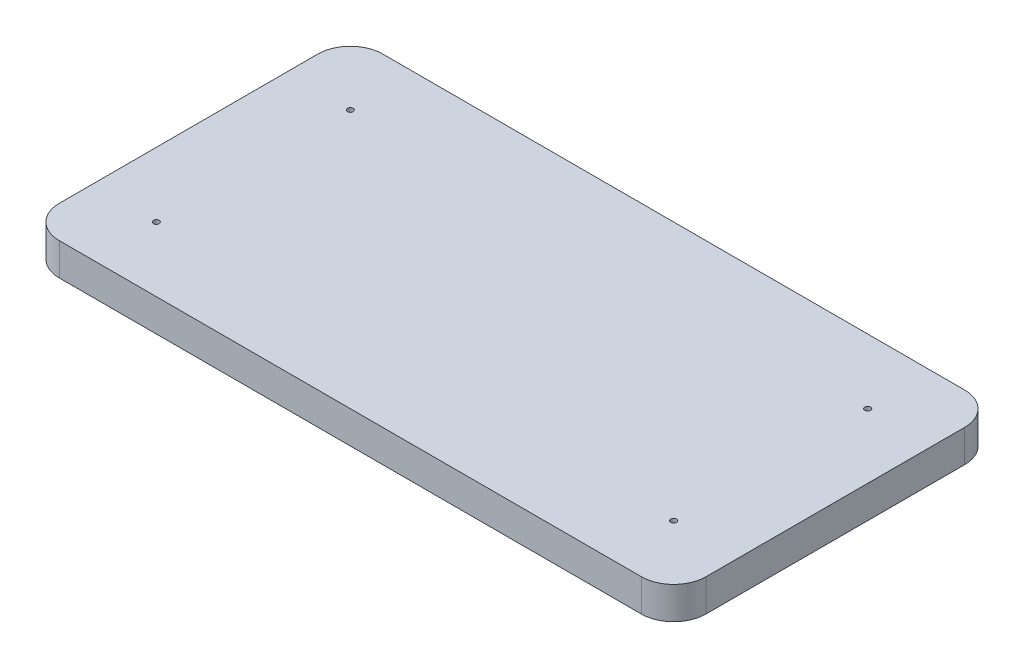
ISO-10303-21;
HEADER;
FILE_DESCRIPTION(('STEP AP214'),'2;1');
FILE_NAME('part.step','',(''),(''),'','','');
FILE_SCHEMA(('AUTOMOTIVE_DESIGN { 1 0 10303 214 1 1 1 1 }'));
ENDSEC;
DATA;
#1=APPLICATION_CONTEXT('core data for automotive mechanical design processes');
#2=APPLICATION_PROTOCOL_DEFINITION('international standard','automotive_design',2000,#1);
#3=PRODUCT_CONTEXT('',#1,'mechanical');
#4=PRODUCT('Part','Part','',(#3));
#5=PRODUCT_RELATED_PRODUCT_CATEGORY('part','',(#4));
#6=PRODUCT_DEFINITION_FORMATION('','',#4);
#7=PRODUCT_DEFINITION_CONTEXT('part definition',#1,'design');
#8=PRODUCT_DEFINITION('design','',#6,#7);
#9=PRODUCT_DEFINITION_SHAPE('','',#8);
#10=(LENGTH_UNIT() NAMED_UNIT(*) SI_UNIT(.MILLI.,.METRE.));
#11=(NAMED_UNIT(*) PLANE_ANGLE_UNIT() SI_UNIT($,.RADIAN.));
#12=(NAMED_UNIT(*) SI_UNIT($,.STERADIAN.) SOLID_ANGLE_UNIT());
#13=UNCERTAINTY_MEASURE_WITH_UNIT(LENGTH_MEASURE(1.E-05),#10,'distance_accuracy_value','');
#14=(GEOMETRIC_REPRESENTATION_CONTEXT(3) GLOBAL_UNCERTAINTY_ASSIGNED_CONTEXT((#13)) GLOBAL_UNIT_ASSIGNED_CONTEXT((#10,
#11,#12)) REPRESENTATION_CONTEXT('',''));
#15=CARTESIAN_POINT('',(0.,0.,0.));
#16=DIRECTION('',(0.,0.,1.));
#17=DIRECTION('',(1.,0.,0.));
#18=AXIS2_PLACEMENT_3D('',#15,#16,#17);
#19=CARTESIAN_POINT('',(2540.,254.,1270.));
#20=DIRECTION('',(-1.,0.,0.));
#21=DIRECTION('',(0.,0.,1.));
#22=AXIS2_PLACEMENT_3D('',#19,#20,#21);
#23=PLANE('',#22);
#24=DIRECTION('',(0.,0.,-1.));
#25=VECTOR('',#24,1.);
#26=CARTESIAN_POINT('',(2540.,0.,1270.));
#27=LINE('',#26,#25);
#28=CARTESIAN_POINT('',(2540.,0.,1016.));
#29=VERTEX_POINT('',#28);
#30=CARTESIAN_POINT('',(2540.,0.,-1016.));
#31=VERTEX_POINT('',#30);
#32=EDGE_CURVE('E138',#29,#31,#27,.T.);
#33=ORIENTED_EDGE('',*,*,#32,.T.);
#34=DIRECTION('',(0.,-1.,0.));
#35=VECTOR('',#34,1.);
#36=CARTESIAN_POINT('',(2540.,254.,-1016.));
#37=LINE('',#36,#35);
#38=CARTESIAN_POINT('',(2540.,254.,-1016.));
#39=VERTEX_POINT('',#38);
#40=EDGE_CURVE('E11',#31,#39,#37,.F.);
#41=ORIENTED_EDGE('',*,*,#40,.T.);
#42=DIRECTION('',(0.,0.,-1.));
#43=VECTOR('',#42,1.);
#44=CARTESIAN_POINT('',(2540.,254.,1270.));
#45=LINE('',#44,#43);
#46=CARTESIAN_POINT('',(2540.,254.,1016.));
#47=VERTEX_POINT('',#46);
#48=EDGE_CURVE('E136',#47,#39,#45,.T.);
#49=ORIENTED_EDGE('',*,*,#48,.F.);
#50=DIRECTION('',(0.,-1.,0.));
#51=VECTOR('',#50,1.);
#52=CARTESIAN_POINT('',(2540.,254.,1016.));
#53=LINE('',#52,#51);
#54=EDGE_CURVE('E50',#47,#29,#53,.T.);
#55=ORIENTED_EDGE('',*,*,#54,.T.);
#56=EDGE_LOOP('',(#33,#41,#49,#55));
#57=FACE_BOUND('',#56,.T.);
#58=ADVANCED_FACE('F42',(#57),#23,.F.);
#59=CARTESIAN_POINT('',(-2540.,254.,-1270.));
#60=DIRECTION('',(0.,0.,1.));
#61=DIRECTION('',(1.,0.,0.));
#62=AXIS2_PLACEMENT_3D('',#59,#60,#61);
#63=PLANE('',#62);
#64=DIRECTION('',(-1.,0.,0.));
#65=VECTOR('',#64,1.);
#66=CARTESIAN_POINT('',(-2540.,0.,-1270.));
#67=LINE('',#66,#65);
#68=CARTESIAN_POINT('',(2286.,0.,-1270.));
#69=VERTEX_POINT('',#68);
#70=CARTESIAN_POINT('',(-2286.,0.,-1270.));
#71=VERTEX_POINT('',#70);
#72=EDGE_CURVE('E134',#69,#71,#67,.T.);
#73=ORIENTED_EDGE('',*,*,#72,.T.);
#74=DIRECTION('',(0.,-1.,0.));
#75=VECTOR('',#74,1.);
#76=CARTESIAN_POINT('',(-2286.,254.,-1270.));
#77=LINE('',#76,#75);
#78=CARTESIAN_POINT('',(-2286.,254.,-1270.));
#79=VERTEX_POINT('',#78);
#80=EDGE_CURVE('E113',#71,#79,#77,.F.);
#81=ORIENTED_EDGE('',*,*,#80,.T.);
#82=DIRECTION('',(-1.,0.,0.));
#83=VECTOR('',#82,1.);
#84=CARTESIAN_POINT('',(-2540.,254.,-1270.));
#85=LINE('',#84,#83);
#86=CARTESIAN_POINT('',(2286.,254.,-1270.));
#87=VERTEX_POINT('',#86);
#88=EDGE_CURVE('E178',#87,#79,#85,.T.);
#89=ORIENTED_EDGE('',*,*,#88,.F.);
#90=DIRECTION('',(0.,-1.,0.));
#91=VECTOR('',#90,1.);
#92=CARTESIAN_POINT('',(2286.,254.,-1270.));
#93=LINE('',#92,#91);
#94=EDGE_CURVE('E118',#87,#69,#93,.T.);
#95=ORIENTED_EDGE('',*,*,#94,.T.);
#96=EDGE_LOOP('',(#73,#81,#89,#95));
#97=FACE_BOUND('',#96,.T.);
#98=ADVANCED_FACE('F219',(#97),#63,.F.);
#99=CARTESIAN_POINT('',(-2540.,254.,1270.));
#100=DIRECTION('',(1.,0.,0.));
#101=DIRECTION('',(0.,0.,-1.));
#102=AXIS2_PLACEMENT_3D('',#99,#100,#101);
#103=PLANE('',#102);
#104=DIRECTION('',(0.,0.,1.));
#105=VECTOR('',#104,1.);
#106=CARTESIAN_POINT('',(-2540.,254.,1270.));
#107=LINE('',#106,#105);
#108=CARTESIAN_POINT('',(-2540.,254.,-1016.));
#109=VERTEX_POINT('',#108);
#110=CARTESIAN_POINT('',(-2540.,254.,1016.));
#111=VERTEX_POINT('',#110);
#112=EDGE_CURVE('E127',#109,#111,#107,.T.);
#113=ORIENTED_EDGE('',*,*,#112,.F.);
#114=DIRECTION('',(0.,-1.,0.));
#115=VECTOR('',#114,1.);
#116=CARTESIAN_POINT('',(-2540.,254.,-1016.));
#117=LINE('',#116,#115);
#118=CARTESIAN_POINT('',(-2540.,0.,-1016.));
#119=VERTEX_POINT('',#118);
#120=EDGE_CURVE('E112',#109,#119,#117,.T.);
#121=ORIENTED_EDGE('',*,*,#120,.T.);
#122=DIRECTION('',(0.,0.,1.));
#123=VECTOR('',#122,1.);
#124=CARTESIAN_POINT('',(-2540.,0.,1270.));
#125=LINE('',#124,#123);
#126=CARTESIAN_POINT('',(-2540.,0.,1016.));
#127=VERTEX_POINT('',#126);
#128=EDGE_CURVE('E125',#119,#127,#125,.T.);
#129=ORIENTED_EDGE('',*,*,#128,.T.);
#130=DIRECTION('',(0.,-1.,0.));
#131=VECTOR('',#130,1.);
#132=CARTESIAN_POINT('',(-2540.,254.,1016.));
#133=LINE('',#132,#131);
#134=EDGE_CURVE('E129',#127,#111,#133,.F.);
#135=ORIENTED_EDGE('',*,*,#134,.T.);
#136=EDGE_LOOP('',(#113,#121,#129,#135));
#137=FACE_BOUND('',#136,.T.);
#138=ADVANCED_FACE('F124',(#137),#103,.F.);
#139=CARTESIAN_POINT('',(-2540.,254.,1270.));
#140=DIRECTION('',(0.,0.,-1.));
#141=DIRECTION('',(-1.,0.,0.));
#142=AXIS2_PLACEMENT_3D('',#139,#140,#141);
#143=PLANE('',#142);
#144=DIRECTION('',(1.,0.,0.));
#145=VECTOR('',#144,1.);
#146=CARTESIAN_POINT('',(-2540.,254.,1270.));
#147=LINE('',#146,#145);
#148=CARTESIAN_POINT('',(-2286.,254.,1270.));
#149=VERTEX_POINT('',#148);
#150=CARTESIAN_POINT('',(2286.,254.,1270.));
#151=VERTEX_POINT('',#150);
#152=EDGE_CURVE('E142',#149,#151,#147,.T.);
#153=ORIENTED_EDGE('',*,*,#152,.F.);
#154=DIRECTION('',(0.,-1.,0.));
#155=VECTOR('',#154,1.);
#156=CARTESIAN_POINT('',(-2286.,254.,1270.));
#157=LINE('',#156,#155);
#158=CARTESIAN_POINT('',(-2286.,0.,1270.));
#159=VERTEX_POINT('',#158);
#160=EDGE_CURVE('E159',#149,#159,#157,.T.);
#161=ORIENTED_EDGE('',*,*,#160,.T.);
#162=DIRECTION('',(1.,0.,0.));
#163=VECTOR('',#162,1.);
#164=CARTESIAN_POINT('',(-2540.,0.,1270.));
#165=LINE('',#164,#163);
#166=CARTESIAN_POINT('',(2286.,0.,1270.));
#167=VERTEX_POINT('',#166);
#168=EDGE_CURVE('E133',#159,#167,#165,.T.);
#169=ORIENTED_EDGE('',*,*,#168,.T.);
#170=DIRECTION('',(0.,-1.,0.));
#171=VECTOR('',#170,1.);
#172=CARTESIAN_POINT('',(2286.,254.,1270.));
#173=LINE('',#172,#171);
#174=EDGE_CURVE('E57',#167,#151,#173,.F.);
#175=ORIENTED_EDGE('',*,*,#174,.T.);
#176=EDGE_LOOP('',(#153,#161,#169,#175));
#177=FACE_BOUND('',#176,.T.);
#178=ADVANCED_FACE('F208',(#177),#143,.F.);
#179=CARTESIAN_POINT('',(0.,254.,0.));
#180=DIRECTION('',(0.,-1.,0.));
#181=DIRECTION('',(0.,0.,-1.));
#182=AXIS2_PLACEMENT_3D('',#179,#180,#181);
#183=PLANE('',#182);
#184=CARTESIAN_POINT('',(-2032.,254.,762.));
#185=DIRECTION('',(0.,1.,0.));
#186=DIRECTION('',(0.,0.,1.));
#187=AXIS2_PLACEMENT_3D('',#184,#185,#186);
#188=CIRCLE('',#187,22.6212399999999);
#189=CARTESIAN_POINT('',(-2032.,254.,784.62124));
#190=VERTEX_POINT('',#189);
#191=EDGE_CURVE('E199',#190,#190,#188,.T.);
#192=ORIENTED_EDGE('',*,*,#191,.F.);
#193=EDGE_LOOP('',(#192));
#194=FACE_BOUND('',#193,.T.);
#195=CARTESIAN_POINT('',(-2032.,254.,-762.));
#196=DIRECTION('',(0.,1.,0.));
#197=DIRECTION('',(0.,0.,1.));
#198=AXIS2_PLACEMENT_3D('',#195,#196,#197);
#199=CIRCLE('',#198,22.6212399999999);
#200=CARTESIAN_POINT('',(-2032.,254.,-739.37876));
#201=VERTEX_POINT('',#200);
#202=EDGE_CURVE('E193',#201,#201,#199,.T.);
#203=ORIENTED_EDGE('',*,*,#202,.F.);
#204=EDGE_LOOP('',(#203));
#205=FACE_BOUND('',#204,.T.);
#206=CARTESIAN_POINT('',(2032.,254.,-762.));
#207=DIRECTION('',(0.,1.,0.));
#208=DIRECTION('',(0.,0.,1.));
#209=AXIS2_PLACEMENT_3D('',#206,#207,#208);
#210=CIRCLE('',#209,22.6212399999999);
#211=CARTESIAN_POINT('',(2032.,254.,-739.37876));
#212=VERTEX_POINT('',#211);
#213=EDGE_CURVE('E187',#212,#212,#210,.T.);
#214=ORIENTED_EDGE('',*,*,#213,.F.);
#215=EDGE_LOOP('',(#214));
#216=FACE_BOUND('',#215,.T.);
#217=CARTESIAN_POINT('',(2032.,254.,762.));
#218=DIRECTION('',(0.,1.,0.));
#219=DIRECTION('',(0.,0.,1.));
#220=AXIS2_PLACEMENT_3D('',#217,#218,#219);
#221=CIRCLE('',#220,22.6212399999999);
#222=CARTESIAN_POINT('',(2032.,254.,784.62124));
#223=VERTEX_POINT('',#222);
#224=EDGE_CURVE('E173',#223,#223,#221,.T.);
#225=ORIENTED_EDGE('',*,*,#224,.F.);
#226=EDGE_LOOP('',(#225));
#227=FACE_BOUND('',#226,.T.);
#228=ORIENTED_EDGE('',*,*,#88,.T.);
#229=CARTESIAN_POINT('',(-2286.,254.,-1016.));
#230=DIRECTION('',(0.,-1.,0.));
#231=DIRECTION('',(0.,0.,-1.));
#232=AXIS2_PLACEMENT_3D('',#229,#230,#231);
#233=CIRCLE('',#232,254.);
#234=EDGE_CURVE('E156',#79,#109,#233,.F.);
#235=ORIENTED_EDGE('',*,*,#234,.T.);
#236=ORIENTED_EDGE('',*,*,#112,.T.);
#237=CARTESIAN_POINT('',(-2286.,254.,1016.));
#238=DIRECTION('',(0.,-1.,0.));
#239=DIRECTION('',(0.,0.,-1.));
#240=AXIS2_PLACEMENT_3D('',#237,#238,#239);
#241=CIRCLE('',#240,254.);
#242=EDGE_CURVE('E64',#111,#149,#241,.F.);
#243=ORIENTED_EDGE('',*,*,#242,.T.);
#244=ORIENTED_EDGE('',*,*,#152,.T.);
#245=CARTESIAN_POINT('',(2286.,254.,1016.));
#246=DIRECTION('',(0.,-1.,0.));
#247=DIRECTION('',(0.,0.,-1.));
#248=AXIS2_PLACEMENT_3D('',#245,#246,#247);
#249=CIRCLE('',#248,254.);
#250=EDGE_CURVE('E151',#151,#47,#249,.F.);
#251=ORIENTED_EDGE('',*,*,#250,.T.);
#252=ORIENTED_EDGE('',*,*,#48,.T.);
#253=CARTESIAN_POINT('',(2286.,254.,-1016.));
#254=DIRECTION('',(0.,-1.,0.));
#255=DIRECTION('',(0.,0.,-1.));
#256=AXIS2_PLACEMENT_3D('',#253,#254,#255);
#257=CIRCLE('',#256,254.);
#258=EDGE_CURVE('E153',#39,#87,#257,.F.);
#259=ORIENTED_EDGE('',*,*,#258,.T.);
#260=EDGE_LOOP('',(#228,#235,#236,#243,#244,#251,#252,#259));
#261=FACE_BOUND('',#260,.T.);
#262=ADVANCED_FACE('F205',(#194,#205,#216,#227,#261),#183,.F.);
#263=CARTESIAN_POINT('',(0.,0.,0.));
#264=DIRECTION('',(0.,-1.,0.));
#265=DIRECTION('',(0.,0.,-1.));
#266=AXIS2_PLACEMENT_3D('',#263,#264,#265);
#267=PLANE('',#266);
#268=CARTESIAN_POINT('',(-2032.,0.,762.));
#269=DIRECTION('',(0.,1.,0.));
#270=DIRECTION('',(0.,0.,1.));
#271=AXIS2_PLACEMENT_3D('',#268,#269,#270);
#272=CIRCLE('',#271,22.6212399999999);
#273=CARTESIAN_POINT('',(-2032.,0.,784.62124));
#274=VERTEX_POINT('',#273);
#275=EDGE_CURVE('E196',#274,#274,#272,.T.);
#276=ORIENTED_EDGE('',*,*,#275,.T.);
#277=EDGE_LOOP('',(#276));
#278=FACE_BOUND('',#277,.T.);
#279=CARTESIAN_POINT('',(-2032.,0.,-762.));
#280=DIRECTION('',(0.,1.,0.));
#281=DIRECTION('',(0.,0.,1.));
#282=AXIS2_PLACEMENT_3D('',#279,#280,#281);
#283=CIRCLE('',#282,22.6212399999999);
#284=CARTESIAN_POINT('',(-2032.,0.,-739.37876));
#285=VERTEX_POINT('',#284);
#286=EDGE_CURVE('E190',#285,#285,#283,.T.);
#287=ORIENTED_EDGE('',*,*,#286,.T.);
#288=EDGE_LOOP('',(#287));
#289=FACE_BOUND('',#288,.T.);
#290=CARTESIAN_POINT('',(2032.,0.,-762.));
#291=DIRECTION('',(0.,1.,0.));
#292=DIRECTION('',(0.,0.,1.));
#293=AXIS2_PLACEMENT_3D('',#290,#291,#292);
#294=CIRCLE('',#293,22.6212399999999);
#295=CARTESIAN_POINT('',(2032.,0.,-739.37876));
#296=VERTEX_POINT('',#295);
#297=EDGE_CURVE('E184',#296,#296,#294,.T.);
#298=ORIENTED_EDGE('',*,*,#297,.T.);
#299=EDGE_LOOP('',(#298));
#300=FACE_BOUND('',#299,.T.);
#301=CARTESIAN_POINT('',(2032.,0.,762.));
#302=DIRECTION('',(0.,1.,0.));
#303=DIRECTION('',(0.,0.,1.));
#304=AXIS2_PLACEMENT_3D('',#301,#302,#303);
#305=CIRCLE('',#304,22.6212399999999);
#306=CARTESIAN_POINT('',(2032.,0.,784.62124));
#307=VERTEX_POINT('',#306);
#308=EDGE_CURVE('E171',#307,#307,#305,.T.);
#309=ORIENTED_EDGE('',*,*,#308,.T.);
#310=EDGE_LOOP('',(#309));
#311=FACE_BOUND('',#310,.T.);
#312=ORIENTED_EDGE('',*,*,#128,.F.);
#313=CARTESIAN_POINT('',(-2286.,0.,-1016.));
#314=DIRECTION('',(0.,-1.,0.));
#315=DIRECTION('',(0.,0.,-1.));
#316=AXIS2_PLACEMENT_3D('',#313,#314,#315);
#317=CIRCLE('',#316,254.);
#318=EDGE_CURVE('E108',#119,#71,#317,.T.);
#319=ORIENTED_EDGE('',*,*,#318,.T.);
#320=ORIENTED_EDGE('',*,*,#72,.F.);
#321=CARTESIAN_POINT('',(2286.,0.,-1016.));
#322=DIRECTION('',(0.,-1.,0.));
#323=DIRECTION('',(0.,0.,-1.));
#324=AXIS2_PLACEMENT_3D('',#321,#322,#323);
#325=CIRCLE('',#324,254.);
#326=EDGE_CURVE('E145',#69,#31,#325,.T.);
#327=ORIENTED_EDGE('',*,*,#326,.T.);
#328=ORIENTED_EDGE('',*,*,#32,.F.);
#329=CARTESIAN_POINT('',(2286.,0.,1016.));
#330=DIRECTION('',(0.,-1.,0.));
#331=DIRECTION('',(0.,0.,-1.));
#332=AXIS2_PLACEMENT_3D('',#329,#330,#331);
#333=CIRCLE('',#332,254.);
#334=EDGE_CURVE('E128',#29,#167,#333,.T.);
#335=ORIENTED_EDGE('',*,*,#334,.T.);
#336=ORIENTED_EDGE('',*,*,#168,.F.);
#337=CARTESIAN_POINT('',(-2286.,0.,1016.));
#338=DIRECTION('',(0.,-1.,0.));
#339=DIRECTION('',(0.,0.,-1.));
#340=AXIS2_PLACEMENT_3D('',#337,#338,#339);
#341=CIRCLE('',#340,254.);
#342=EDGE_CURVE('E119',#159,#127,#341,.T.);
#343=ORIENTED_EDGE('',*,*,#342,.T.);
#344=EDGE_LOOP('',(#312,#319,#320,#327,#328,#335,#336,#343));
#345=FACE_BOUND('',#344,.T.);
#346=ADVANCED_FACE('F131',(#278,#289,#300,#311,#345),#267,.T.);
#347=CARTESIAN_POINT('',(2032.,254.,762.));
#348=DIRECTION('',(0.,1.,0.));
#349=DIRECTION('',(0.,0.,1.));
#350=AXIS2_PLACEMENT_3D('',#347,#348,#349);
#351=CYLINDRICAL_SURFACE('',#350,22.6212399999999);
#352=ORIENTED_EDGE('',*,*,#308,.F.);
#353=EDGE_LOOP('',(#352));
#354=FACE_BOUND('',#353,.T.);
#355=ORIENTED_EDGE('',*,*,#224,.T.);
#356=EDGE_LOOP('',(#355));
#357=FACE_BOUND('',#356,.T.);
#358=ADVANCED_FACE('F249',(#354,#357),#351,.F.);
#359=CARTESIAN_POINT('',(2032.,254.,-762.));
#360=DIRECTION('',(0.,1.,0.));
#361=DIRECTION('',(0.,0.,1.));
#362=AXIS2_PLACEMENT_3D('',#359,#360,#361);
#363=CYLINDRICAL_SURFACE('',#362,22.6212399999999);
#364=ORIENTED_EDGE('',*,*,#297,.F.);
#365=EDGE_LOOP('',(#364));
#366=FACE_BOUND('',#365,.T.);
#367=ORIENTED_EDGE('',*,*,#213,.T.);
#368=EDGE_LOOP('',(#367));
#369=FACE_BOUND('',#368,.T.);
#370=ADVANCED_FACE('F254',(#366,#369),#363,.F.);
#371=CARTESIAN_POINT('',(-2032.,254.,-762.));
#372=DIRECTION('',(0.,1.,0.));
#373=DIRECTION('',(0.,0.,1.));
#374=AXIS2_PLACEMENT_3D('',#371,#372,#373);
#375=CYLINDRICAL_SURFACE('',#374,22.6212399999999);
#376=ORIENTED_EDGE('',*,*,#286,.F.);
#377=EDGE_LOOP('',(#376));
#378=FACE_BOUND('',#377,.T.);
#379=ORIENTED_EDGE('',*,*,#202,.T.);
#380=EDGE_LOOP('',(#379));
#381=FACE_BOUND('',#380,.T.);
#382=ADVANCED_FACE('F258',(#378,#381),#375,.F.);
#383=CARTESIAN_POINT('',(-2032.,254.,762.));
#384=DIRECTION('',(0.,1.,0.));
#385=DIRECTION('',(0.,0.,1.));
#386=AXIS2_PLACEMENT_3D('',#383,#384,#385);
#387=CYLINDRICAL_SURFACE('',#386,22.6212399999999);
#388=ORIENTED_EDGE('',*,*,#275,.F.);
#389=EDGE_LOOP('',(#388));
#390=FACE_BOUND('',#389,.T.);
#391=ORIENTED_EDGE('',*,*,#191,.T.);
#392=EDGE_LOOP('',(#391));
#393=FACE_BOUND('',#392,.T.);
#394=ADVANCED_FACE('F203',(#390,#393),#387,.F.);
#395=CARTESIAN_POINT('',(-2286.,254.,-1016.));
#396=DIRECTION('',(0.,-1.,0.));
#397=DIRECTION('',(0.,0.,-1.));
#398=AXIS2_PLACEMENT_3D('',#395,#396,#397);
#399=CYLINDRICAL_SURFACE('',#398,254.);
#400=ORIENTED_EDGE('',*,*,#234,.F.);
#401=ORIENTED_EDGE('',*,*,#80,.F.);
#402=ORIENTED_EDGE('',*,*,#318,.F.);
#403=ORIENTED_EDGE('',*,*,#120,.F.);
#404=EDGE_LOOP('',(#400,#401,#402,#403));
#405=FACE_BOUND('',#404,.T.);
#406=ADVANCED_FACE('F111',(#405),#399,.T.);
#407=CARTESIAN_POINT('',(-2286.,254.,1016.));
#408=DIRECTION('',(0.,-1.,0.));
#409=DIRECTION('',(0.,0.,-1.));
#410=AXIS2_PLACEMENT_3D('',#407,#408,#409);
#411=CYLINDRICAL_SURFACE('',#410,254.);
#412=ORIENTED_EDGE('',*,*,#242,.F.);
#413=ORIENTED_EDGE('',*,*,#134,.F.);
#414=ORIENTED_EDGE('',*,*,#342,.F.);
#415=ORIENTED_EDGE('',*,*,#160,.F.);
#416=EDGE_LOOP('',(#412,#413,#414,#415));
#417=FACE_BOUND('',#416,.T.);
#418=ADVANCED_FACE('F226',(#417),#411,.T.);
#419=CARTESIAN_POINT('',(2286.,254.,-1016.));
#420=DIRECTION('',(0.,-1.,0.));
#421=DIRECTION('',(0.,0.,-1.));
#422=AXIS2_PLACEMENT_3D('',#419,#420,#421);
#423=CYLINDRICAL_SURFACE('',#422,254.);
#424=ORIENTED_EDGE('',*,*,#258,.F.);
#425=ORIENTED_EDGE('',*,*,#40,.F.);
#426=ORIENTED_EDGE('',*,*,#326,.F.);
#427=ORIENTED_EDGE('',*,*,#94,.F.);
#428=EDGE_LOOP('',(#424,#425,#426,#427));
#429=FACE_BOUND('',#428,.T.);
#430=ADVANCED_FACE('F221',(#429),#423,.T.);
#431=CARTESIAN_POINT('',(2286.,254.,1016.));
#432=DIRECTION('',(0.,-1.,0.));
#433=DIRECTION('',(0.,0.,-1.));
#434=AXIS2_PLACEMENT_3D('',#431,#432,#433);
#435=CYLINDRICAL_SURFACE('',#434,254.);
#436=ORIENTED_EDGE('',*,*,#250,.F.);
#437=ORIENTED_EDGE('',*,*,#174,.F.);
#438=ORIENTED_EDGE('',*,*,#334,.F.);
#439=ORIENTED_EDGE('',*,*,#54,.F.);
#440=EDGE_LOOP('',(#436,#437,#438,#439));
#441=FACE_BOUND('',#440,.T.);
#442=ADVANCED_FACE('F44',(#441),#435,.T.);
#443=CLOSED_SHELL('',(#58,#98,#138,#178,#262,#346,#358,#370,#382,#394,#406,#418,#430,#442));
#444=MANIFOLD_SOLID_BREP('B2',#443);
#445=ADVANCED_BREP_SHAPE_REPRESENTATION('',(#18,#444),#14);
#446=SHAPE_DEFINITION_REPRESENTATION(#9,#445);
ENDSEC;
END-ISO-10303-21;
